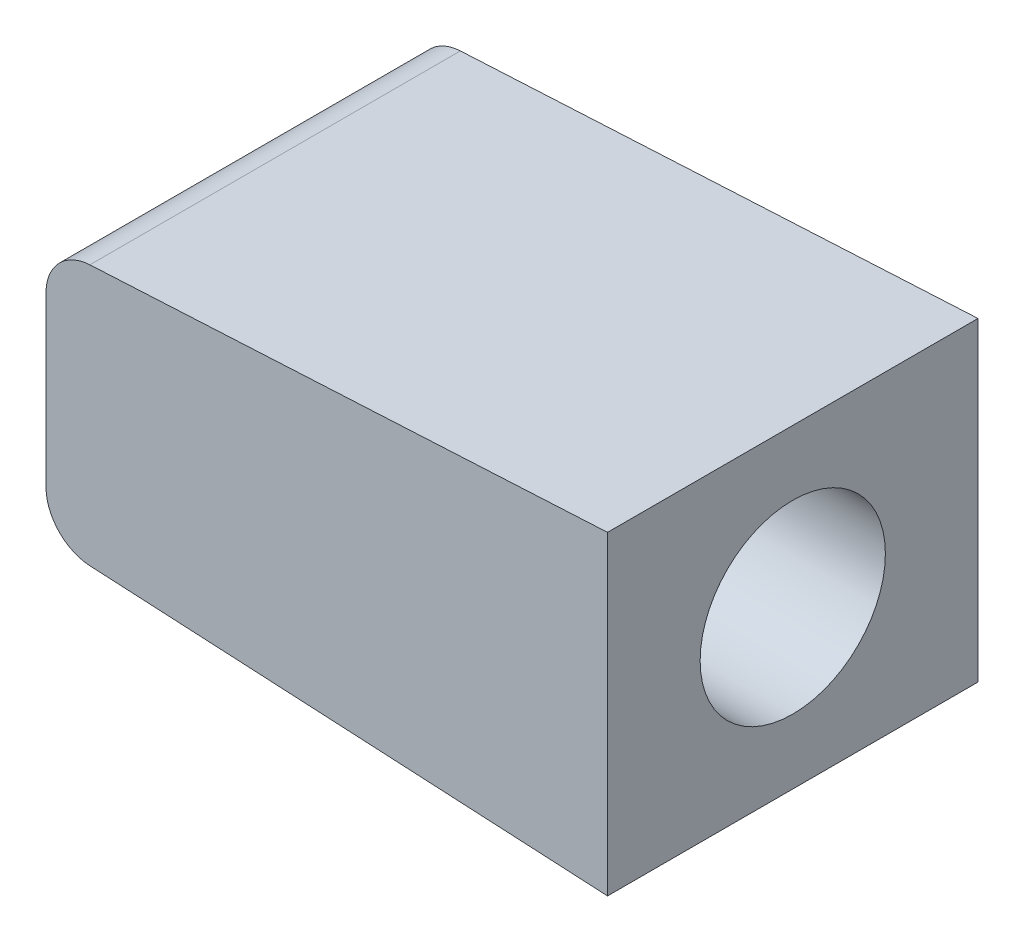
ISO-10303-21;
HEADER;
FILE_DESCRIPTION(('STEP AP214'),'2;1');
FILE_NAME('part.step','',(''),(''),'','','');
FILE_SCHEMA(('AUTOMOTIVE_DESIGN { 1 0 10303 214 1 1 1 1 }'));
ENDSEC;
DATA;
#1=APPLICATION_CONTEXT('core data for automotive mechanical design processes');
#2=APPLICATION_PROTOCOL_DEFINITION('international standard','automotive_design',2000,#1);
#3=PRODUCT_CONTEXT('',#1,'mechanical');
#4=PRODUCT('Part','Part','',(#3));
#5=PRODUCT_RELATED_PRODUCT_CATEGORY('part','',(#4));
#6=PRODUCT_DEFINITION_FORMATION('','',#4);
#7=PRODUCT_DEFINITION_CONTEXT('part definition',#1,'design');
#8=PRODUCT_DEFINITION('design','',#6,#7);
#9=PRODUCT_DEFINITION_SHAPE('','',#8);
#10=(LENGTH_UNIT() NAMED_UNIT(*) SI_UNIT(.MILLI.,.METRE.));
#11=(NAMED_UNIT(*) PLANE_ANGLE_UNIT() SI_UNIT($,.RADIAN.));
#12=(NAMED_UNIT(*) SI_UNIT($,.STERADIAN.) SOLID_ANGLE_UNIT());
#13=UNCERTAINTY_MEASURE_WITH_UNIT(LENGTH_MEASURE(1.E-05),#10,'distance_accuracy_value','');
#14=(GEOMETRIC_REPRESENTATION_CONTEXT(3) GLOBAL_UNCERTAINTY_ASSIGNED_CONTEXT((#13)) GLOBAL_UNIT_ASSIGNED_CONTEXT((#10,
#11,#12)) REPRESENTATION_CONTEXT('',''));
#15=CARTESIAN_POINT('',(0.,0.,0.));
#16=DIRECTION('',(0.,0.,1.));
#17=DIRECTION('',(1.,0.,0.));
#18=AXIS2_PLACEMENT_3D('',#15,#16,#17);
#19=CARTESIAN_POINT('',(30.,204.196648924623,-7.99999999999409));
#20=DIRECTION('',(-1.,0.,0.));
#21=DIRECTION('',(0.,0.,1.));
#22=AXIS2_PLACEMENT_3D('',#19,#20,#21);
#23=PLANE('',#22);
#24=CARTESIAN_POINT('',(30.,202.381065112594,-3.99999999999704));
#25=DIRECTION('',(1.,0.,0.));
#26=DIRECTION('',(0.,0.,-1.));
#27=AXIS2_PLACEMENT_3D('',#24,#25,#26);
#28=CIRCLE('',#27,2.0000000000027);
#29=CARTESIAN_POINT('',(30.,200.565481300566,-4.83884171421441));
#30=VERTEX_POINT('',#29);
#31=CARTESIAN_POINT('',(30.,204.196648924623,-4.83884171421429));
#32=VERTEX_POINT('',#31);
#33=EDGE_CURVE('E110',#30,#32,#28,.T.);
#34=ORIENTED_EDGE('',*,*,#33,.T.);
#35=DIRECTION('',(0.,0.,1.));
#36=VECTOR('',#35,1.);
#37=CARTESIAN_POINT('',(30.,204.196648924623,-7.99999999999409));
#38=LINE('',#37,#36);
#39=CARTESIAN_POINT('',(30.,204.196648924623,-7.99999999999409));
#40=VERTEX_POINT('',#39);
#41=EDGE_CURVE('E103',#40,#32,#38,.T.);
#42=ORIENTED_EDGE('',*,*,#41,.F.);
#43=DIRECTION('',(0.,-1.,0.));
#44=VECTOR('',#43,1.);
#45=CARTESIAN_POINT('',(30.,204.196648924623,-7.99999999999409));
#46=LINE('',#45,#44);
#47=CARTESIAN_POINT('',(30.,200.565481300566,-7.99999999999409));
#48=VERTEX_POINT('',#47);
#49=EDGE_CURVE('E106',#40,#48,#46,.T.);
#50=ORIENTED_EDGE('',*,*,#49,.T.);
#51=DIRECTION('',(0.,0.,1.));
#52=VECTOR('',#51,1.);
#53=CARTESIAN_POINT('',(30.,200.565481300566,-7.99999999999409));
#54=LINE('',#53,#52);
#55=EDGE_CURVE('E42',#48,#30,#54,.T.);
#56=ORIENTED_EDGE('',*,*,#55,.T.);
#57=EDGE_LOOP('',(#34,#42,#50,#56));
#58=FACE_BOUND('',#57,.T.);
#59=ADVANCED_FACE('F33',(#58),#23,.T.);
#60=CARTESIAN_POINT('',(42.1251392436371,198.981065112594,-7.99999999999409));
#61=DIRECTION('',(-0.0523359562429445,-0.998629534754574,0.));
#62=DIRECTION('',(0.998629534754574,-0.0523359562429446,0.));
#63=AXIS2_PLACEMENT_3D('',#60,#61,#62);
#64=PLANE('',#63);
#65=DIRECTION('',(0.998629534754574,-0.0523359562429445,0.));
#66=VECTOR('',#65,1.);
#67=CARTESIAN_POINT('',(42.1251392436371,198.981065112594,0.));
#68=LINE('',#67,#66);
#69=CARTESIAN_POINT('',(30.9476640437571,199.566851765811,0.));
#70=VERTEX_POINT('',#69);
#71=CARTESIAN_POINT('',(42.1251392436371,198.981065112594,0.));
#72=VERTEX_POINT('',#71);
#73=EDGE_CURVE('E134',#70,#72,#68,.T.);
#74=ORIENTED_EDGE('',*,*,#73,.F.);
#75=DIRECTION('',(0.,0.,1.));
#76=VECTOR('',#75,1.);
#77=CARTESIAN_POINT('',(30.9476640437571,199.566851765811,-7.99999999999409));
#78=LINE('',#77,#76);
#79=CARTESIAN_POINT('',(30.9476640437571,199.566851765811,-7.99999999999409));
#80=VERTEX_POINT('',#79);
#81=EDGE_CURVE('E11',#80,#70,#78,.T.);
#82=ORIENTED_EDGE('',*,*,#81,.F.);
#83=DIRECTION('',(0.998629534754574,-0.0523359562429445,0.));
#84=VECTOR('',#83,1.);
#85=CARTESIAN_POINT('',(42.1251392436371,198.981065112594,-7.99999999999409));
#86=LINE('',#85,#84);
#87=CARTESIAN_POINT('',(42.1251392436371,198.981065112594,-7.99999999999409));
#88=VERTEX_POINT('',#87);
#89=EDGE_CURVE('E152',#80,#88,#86,.T.);
#90=ORIENTED_EDGE('',*,*,#89,.T.);
#91=DIRECTION('',(0.,0.,1.));
#92=VECTOR('',#91,1.);
#93=CARTESIAN_POINT('',(42.1251392436371,198.981065112594,-7.99999999999409));
#94=LINE('',#93,#92);
#95=EDGE_CURVE('E37',#88,#72,#94,.T.);
#96=ORIENTED_EDGE('',*,*,#95,.T.);
#97=EDGE_LOOP('',(#74,#82,#90,#96));
#98=FACE_BOUND('',#97,.T.);
#99=ADVANCED_FACE('F35',(#98),#64,.T.);
#100=CARTESIAN_POINT('',(31.,200.565481300566,-7.99999999999409));
#101=DIRECTION('',(0.,0.,1.));
#102=DIRECTION('',(1.,0.,0.));
#103=AXIS2_PLACEMENT_3D('',#100,#101,#102);
#104=CYLINDRICAL_SURFACE('',#103,1.);
#105=CARTESIAN_POINT('',(30.,200.565481300566,-4.83884171421441));
#106=CARTESIAN_POINT('',(30.000025519411,200.542072055417,-4.78818736310272));
#107=CARTESIAN_POINT('',(30.0008226513992,200.520798252127,-4.73656245583858));
#108=CARTESIAN_POINT('',(30.0032470507234,200.48264081428,-4.63173604004667));
#109=CARTESIAN_POINT('',(30.0048742580312,200.465756862397,-4.57853464578717));
#110=CARTESIAN_POINT('',(30.0082446666595,200.436505940665,-4.47095260180949));
#111=CARTESIAN_POINT('',(30.009987780276,200.424135600424,-4.41657286425942));
#112=CARTESIAN_POINT('',(30.0130748059325,200.403976436333,-4.3069607515469));
#113=CARTESIAN_POINT('',(30.0144187366452,200.396187398165,-4.25172841639388));
#114=CARTESIAN_POINT('',(30.01636501407,200.385222110688,-4.14052488144038));
#115=CARTESIAN_POINT('',(30.0169637616369,200.382068235517,-4.08455140527783));
#116=CARTESIAN_POINT('',(30.0172633563397,200.380469368386,-3.97253505371419));
#117=CARTESIAN_POINT('',(30.0169642041562,200.382024372857,-3.91649217836573));
#118=CARTESIAN_POINT('',(30.015540042167,200.389827577609,-3.80479776840952));
#119=CARTESIAN_POINT('',(30.014415816119,200.396071324072,-3.74914591297811));
#120=CARTESIAN_POINT('',(30.0116259733239,200.413194239463,-3.63859518247374));
#121=CARTESIAN_POINT('',(30.0099604987191,200.424072191594,-3.58369611364524));
#122=CARTESIAN_POINT('',(30.0062756068505,200.452555965583,-3.4660633195316));
#123=CARTESIAN_POINT('',(30.0042429706649,200.470973126856,-3.40352302395431));
#124=CARTESIAN_POINT('',(30.0018911640162,200.503091196895,-3.31132501831519));
#125=CARTESIAN_POINT('',(30.0012235594042,200.514539959316,-3.28087404326692));
#126=CARTESIAN_POINT('',(30.0002790019886,200.538911430621,-3.22055954280039));
#127=CARTESIAN_POINT('',(30.0000020754336,200.55183423848,-3.19069605698693));
#128=CARTESIAN_POINT('',(30.,200.565481300566,-3.16115828577967));
#129=B_SPLINE_CURVE_WITH_KNOTS('',3,(#105,#106,#107,#108,#109,#110,#111,#112,#113,#114,#115,
#116,#117,#118,#119,#120,#121,#122,#123,#124,#125,#126,#127,#128),.UNSPECIFIED.,.F.,.F.,(4,2,2,
2,2,2,2,2,2,2,2,4),(0.,0.167332415088625,0.334652730972116,0.501847848907197,0.66903514466694,
0.837026840146407,1.00501840827859,1.17285060336822,1.34063875805414,1.53597297636761,
1.63355484599852,1.73114327159237),.UNSPECIFIED.);
#130=CARTESIAN_POINT('',(30.,200.565481300566,-3.16115828577968));
#131=VERTEX_POINT('',#130);
#132=EDGE_CURVE('E138',#30,#131,#129,.T.);
#133=ORIENTED_EDGE('',*,*,#132,.F.);
#134=ORIENTED_EDGE('',*,*,#55,.F.);
#135=CARTESIAN_POINT('',(31.,200.565481300566,-7.99999999999409));
#136=DIRECTION('',(0.,0.,1.));
#137=DIRECTION('',(-1.,0.,0.));
#138=AXIS2_PLACEMENT_3D('',#135,#136,#137);
#139=CIRCLE('',#138,1.);
#140=EDGE_CURVE('E122',#48,#80,#139,.T.);
#141=ORIENTED_EDGE('',*,*,#140,.T.);
#142=ORIENTED_EDGE('',*,*,#81,.T.);
#143=CARTESIAN_POINT('',(31.,200.565481300566,0.));
#144=DIRECTION('',(0.,0.,1.));
#145=DIRECTION('',(-1.,0.,0.));
#146=AXIS2_PLACEMENT_3D('',#143,#144,#145);
#147=CIRCLE('',#146,1.);
#148=CARTESIAN_POINT('',(30.,200.565481300566,0.));
#149=VERTEX_POINT('',#148);
#150=EDGE_CURVE('E150',#149,#70,#147,.T.);
#151=ORIENTED_EDGE('',*,*,#150,.F.);
#152=EDGE_CURVE('E113',#131,#149,#54,.T.);
#153=ORIENTED_EDGE('',*,*,#152,.F.);
#154=EDGE_LOOP('',(#133,#134,#141,#142,#151,#153));
#155=FACE_BOUND('',#154,.T.);
#156=ADVANCED_FACE('F163',(#155),#104,.T.);
#157=CARTESIAN_POINT('',(30.,204.196648924623,-3.1611582857798));
#158=VERTEX_POINT('',#157);
#159=EDGE_CURVE('E50',#158,#131,#28,.T.);
#160=ORIENTED_EDGE('',*,*,#159,.T.);
#161=ORIENTED_EDGE('',*,*,#152,.T.);
#162=DIRECTION('',(0.,-1.,0.));
#163=VECTOR('',#162,1.);
#164=CARTESIAN_POINT('',(30.,204.196648924623,0.));
#165=LINE('',#164,#163);
#166=CARTESIAN_POINT('',(30.,204.196648924623,0.));
#167=VERTEX_POINT('',#166);
#168=EDGE_CURVE('E147',#167,#149,#165,.T.);
#169=ORIENTED_EDGE('',*,*,#168,.F.);
#170=EDGE_CURVE('E114',#158,#167,#38,.T.);
#171=ORIENTED_EDGE('',*,*,#170,.F.);
#172=EDGE_LOOP('',(#160,#161,#169,#171));
#173=FACE_BOUND('',#172,.T.);
#174=ADVANCED_FACE('F166',(#173),#23,.T.);
#175=CARTESIAN_POINT('',(31.,204.196648924623,-7.99999999999409));
#176=DIRECTION('',(0.,0.,1.));
#177=DIRECTION('',(1.,0.,0.));
#178=AXIS2_PLACEMENT_3D('',#175,#176,#177);
#179=CYLINDRICAL_SURFACE('',#178,1.);
#180=CARTESIAN_POINT('',(30.,204.196648924623,-3.1611582857798));
#181=CARTESIAN_POINT('',(30.000025519411,204.220058169772,-3.21181263689149));
#182=CARTESIAN_POINT('',(30.0008226513991,204.241331973061,-3.26343754415564));
#183=CARTESIAN_POINT('',(30.0032470507234,204.279489410908,-3.36826395994756));
#184=CARTESIAN_POINT('',(30.0048742580312,204.296373362792,-3.42146535420706));
#185=CARTESIAN_POINT('',(30.0082446666595,204.325624284524,-3.52904739818475));
#186=CARTESIAN_POINT('',(30.009987780276,204.337994624765,-3.58342713573481));
#187=CARTESIAN_POINT('',(30.0130748059325,204.358153788856,-3.69303924844733));
#188=CARTESIAN_POINT('',(30.0144187366452,204.365942827024,-3.74827158360035));
#189=CARTESIAN_POINT('',(30.01636501407,204.376908114501,-3.85947511855385));
#190=CARTESIAN_POINT('',(30.0169637616369,204.380061989672,-3.9154485947164));
#191=CARTESIAN_POINT('',(30.0172633563397,204.381660856802,-4.02746494628005));
#192=CARTESIAN_POINT('',(30.0169642041561,204.380105852332,-4.08350782162851));
#193=CARTESIAN_POINT('',(30.015540042167,204.372302647579,-4.19520223158472));
#194=CARTESIAN_POINT('',(30.014415816119,204.366058901117,-4.25085408701613));
#195=CARTESIAN_POINT('',(30.0116259733238,204.348935985725,-4.36140481752049));
#196=CARTESIAN_POINT('',(30.0099604987191,204.338058033595,-4.41630388634899));
#197=CARTESIAN_POINT('',(30.0062756068505,204.309574259605,-4.53393668046258));
#198=CARTESIAN_POINT('',(30.0042429706649,204.291157098333,-4.59647697603983));
#199=CARTESIAN_POINT('',(30.0018911640162,204.259039028294,-4.68867498167887));
#200=CARTESIAN_POINT('',(30.0012235594042,204.247590265873,-4.71912595672712));
#201=CARTESIAN_POINT('',(30.0002790019886,204.223218794567,-4.77944045719361));
#202=CARTESIAN_POINT('',(30.0000020754336,204.210295986708,-4.80930394300705));
#203=CARTESIAN_POINT('',(30.,204.196648924623,-4.83884171421429));
#204=B_SPLINE_CURVE_WITH_KNOTS('',3,(#180,#181,#182,#183,#184,#185,#186,#187,#188,#189,#190,
#191,#192,#193,#194,#195,#196,#197,#198,#199,#200,#201,#202,#203),.UNSPECIFIED.,.F.,.F.,(4,2,2,
2,2,2,2,2,2,2,2,4),(0.,0.16733241508864,0.33465273097213,0.501847848907208,0.66903514466695,
0.837026840146423,1.00501840827861,1.17285060336824,1.34063875805415,1.53597297636747,
1.63355484599831,1.7311432715921),.UNSPECIFIED.);
#205=EDGE_CURVE('E168',#158,#32,#204,.T.);
#206=ORIENTED_EDGE('',*,*,#205,.F.);
#207=ORIENTED_EDGE('',*,*,#170,.T.);
#208=CARTESIAN_POINT('',(31.,204.196648924623,0.));
#209=DIRECTION('',(0.,0.,1.));
#210=DIRECTION('',(1.,0.,0.));
#211=AXIS2_PLACEMENT_3D('',#208,#209,#210);
#212=CIRCLE('',#211,1.);
#213=CARTESIAN_POINT('',(30.9476640437571,205.195278459377,0.));
#214=VERTEX_POINT('',#213);
#215=EDGE_CURVE('E144',#214,#167,#212,.T.);
#216=ORIENTED_EDGE('',*,*,#215,.F.);
#217=DIRECTION('',(0.,0.,1.));
#218=VECTOR('',#217,1.);
#219=CARTESIAN_POINT('',(30.9476640437571,205.195278459377,-7.99999999999409));
#220=LINE('',#219,#218);
#221=CARTESIAN_POINT('',(30.9476640437571,205.195278459377,-7.99999999999409));
#222=VERTEX_POINT('',#221);
#223=EDGE_CURVE('E126',#222,#214,#220,.T.);
#224=ORIENTED_EDGE('',*,*,#223,.F.);
#225=CARTESIAN_POINT('',(31.,204.196648924623,-7.99999999999409));
#226=DIRECTION('',(0.,0.,1.));
#227=DIRECTION('',(1.,0.,0.));
#228=AXIS2_PLACEMENT_3D('',#225,#226,#227);
#229=CIRCLE('',#228,1.);
#230=EDGE_CURVE('E120',#222,#40,#229,.T.);
#231=ORIENTED_EDGE('',*,*,#230,.T.);
#232=ORIENTED_EDGE('',*,*,#41,.T.);
#233=EDGE_LOOP('',(#206,#207,#216,#224,#231,#232));
#234=FACE_BOUND('',#233,.T.);
#235=ADVANCED_FACE('F124',(#234),#179,.T.);
#236=CARTESIAN_POINT('',(42.1251392436371,205.781065112594,-7.99999999999409));
#237=DIRECTION('',(-0.0523359562429396,0.998629534754574,0.));
#238=DIRECTION('',(-0.998629534754574,-0.0523359562429396,0.));
#239=AXIS2_PLACEMENT_3D('',#236,#237,#238);
#240=PLANE('',#239);
#241=DIRECTION('',(-0.998629534754574,-0.0523359562429396,0.));
#242=VECTOR('',#241,1.);
#243=CARTESIAN_POINT('',(42.1251392436371,205.781065112594,0.));
#244=LINE('',#243,#242);
#245=CARTESIAN_POINT('',(42.1251392436371,205.781065112594,0.));
#246=VERTEX_POINT('',#245);
#247=EDGE_CURVE('E141',#246,#214,#244,.T.);
#248=ORIENTED_EDGE('',*,*,#247,.F.);
#249=DIRECTION('',(0.,0.,1.));
#250=VECTOR('',#249,1.);
#251=CARTESIAN_POINT('',(42.1251392436371,205.781065112594,-7.99999999999409));
#252=LINE('',#251,#250);
#253=CARTESIAN_POINT('',(42.1251392436371,205.781065112594,-7.99999999999409));
#254=VERTEX_POINT('',#253);
#255=EDGE_CURVE('E155',#254,#246,#252,.T.);
#256=ORIENTED_EDGE('',*,*,#255,.F.);
#257=DIRECTION('',(-0.998629534754574,-0.0523359562429396,0.));
#258=VECTOR('',#257,1.);
#259=CARTESIAN_POINT('',(42.1251392436371,205.781065112594,-7.99999999999409));
#260=LINE('',#259,#258);
#261=EDGE_CURVE('E127',#254,#222,#260,.T.);
#262=ORIENTED_EDGE('',*,*,#261,.T.);
#263=ORIENTED_EDGE('',*,*,#223,.T.);
#264=EDGE_LOOP('',(#248,#256,#262,#263));
#265=FACE_BOUND('',#264,.T.);
#266=ADVANCED_FACE('F204',(#265),#240,.T.);
#267=CARTESIAN_POINT('',(42.1251392436371,205.781065112594,-7.99999999999409));
#268=DIRECTION('',(1.,0.,0.));
#269=DIRECTION('',(0.,0.,-1.));
#270=AXIS2_PLACEMENT_3D('',#267,#268,#269);
#271=PLANE('',#270);
#272=CARTESIAN_POINT('',(42.1251392436371,202.381065112594,-3.99999999999704));
#273=DIRECTION('',(1.,0.,0.));
#274=DIRECTION('',(0.,0.,-1.));
#275=AXIS2_PLACEMENT_3D('',#272,#273,#274);
#276=CIRCLE('',#275,2.0000000000027);
#277=CARTESIAN_POINT('',(42.1251392436371,202.381065112594,-5.99999999999975));
#278=VERTEX_POINT('',#277);
#279=EDGE_CURVE('E171',#278,#278,#276,.T.);
#280=ORIENTED_EDGE('',*,*,#279,.F.);
#281=EDGE_LOOP('',(#280));
#282=FACE_BOUND('',#281,.T.);
#283=DIRECTION('',(0.,1.,0.));
#284=VECTOR('',#283,1.);
#285=CARTESIAN_POINT('',(42.1251392436371,205.781065112594,0.));
#286=LINE('',#285,#284);
#287=EDGE_CURVE('E137',#72,#246,#286,.T.);
#288=ORIENTED_EDGE('',*,*,#287,.F.);
#289=ORIENTED_EDGE('',*,*,#95,.F.);
#290=DIRECTION('',(0.,1.,0.));
#291=VECTOR('',#290,1.);
#292=CARTESIAN_POINT('',(42.1251392436371,205.781065112594,-7.99999999999409));
#293=LINE('',#292,#291);
#294=EDGE_CURVE('E129',#88,#254,#293,.T.);
#295=ORIENTED_EDGE('',*,*,#294,.T.);
#296=ORIENTED_EDGE('',*,*,#255,.T.);
#297=EDGE_LOOP('',(#288,#289,#295,#296));
#298=FACE_BOUND('',#297,.T.);
#299=ADVANCED_FACE('F157',(#282,#298),#271,.T.);
#300=CARTESIAN_POINT('',(31.,200.565481300566,-7.99999999999409));
#301=DIRECTION('',(0.,0.,-1.));
#302=DIRECTION('',(-1.,0.,0.));
#303=AXIS2_PLACEMENT_3D('',#300,#301,#302);
#304=PLANE('',#303);
#305=ORIENTED_EDGE('',*,*,#89,.F.);
#306=ORIENTED_EDGE('',*,*,#140,.F.);
#307=ORIENTED_EDGE('',*,*,#49,.F.);
#308=ORIENTED_EDGE('',*,*,#230,.F.);
#309=ORIENTED_EDGE('',*,*,#261,.F.);
#310=ORIENTED_EDGE('',*,*,#294,.F.);
#311=EDGE_LOOP('',(#305,#306,#307,#308,#309,#310));
#312=FACE_BOUND('',#311,.T.);
#313=ADVANCED_FACE('F118',(#312),#304,.T.);
#314=CARTESIAN_POINT('',(31.,200.565481300566,0.));
#315=DIRECTION('',(0.,0.,-1.));
#316=DIRECTION('',(-1.,0.,0.));
#317=AXIS2_PLACEMENT_3D('',#314,#315,#316);
#318=PLANE('',#317);
#319=ORIENTED_EDGE('',*,*,#73,.T.);
#320=ORIENTED_EDGE('',*,*,#287,.T.);
#321=ORIENTED_EDGE('',*,*,#247,.T.);
#322=ORIENTED_EDGE('',*,*,#215,.T.);
#323=ORIENTED_EDGE('',*,*,#168,.T.);
#324=ORIENTED_EDGE('',*,*,#150,.T.);
#325=EDGE_LOOP('',(#319,#320,#321,#322,#323,#324));
#326=FACE_BOUND('',#325,.T.);
#327=ADVANCED_FACE('F159',(#326),#318,.F.);
#328=CARTESIAN_POINT('',(30.,202.381065112594,-3.99999999999704));
#329=DIRECTION('',(1.,0.,0.));
#330=DIRECTION('',(0.,0.,-1.));
#331=AXIS2_PLACEMENT_3D('',#328,#329,#330);
#332=CYLINDRICAL_SURFACE('',#331,2.0000000000027);
#333=ORIENTED_EDGE('',*,*,#132,.T.);
#334=ORIENTED_EDGE('',*,*,#159,.F.);
#335=ORIENTED_EDGE('',*,*,#205,.T.);
#336=ORIENTED_EDGE('',*,*,#33,.F.);
#337=EDGE_LOOP('',(#333,#334,#335,#336));
#338=FACE_BOUND('',#337,.T.);
#339=ORIENTED_EDGE('',*,*,#279,.T.);
#340=EDGE_LOOP('',(#339));
#341=FACE_BOUND('',#340,.T.);
#342=ADVANCED_FACE('F190',(#338,#341),#332,.F.);
#343=CLOSED_SHELL('',(#59,#99,#156,#174,#235,#266,#299,#313,#327,#342));
#344=MANIFOLD_SOLID_BREP('B2',#343);
#345=ADVANCED_BREP_SHAPE_REPRESENTATION('',(#18,#344),#14);
#346=SHAPE_DEFINITION_REPRESENTATION(#9,#345);
ENDSEC;
END-ISO-10303-21;
